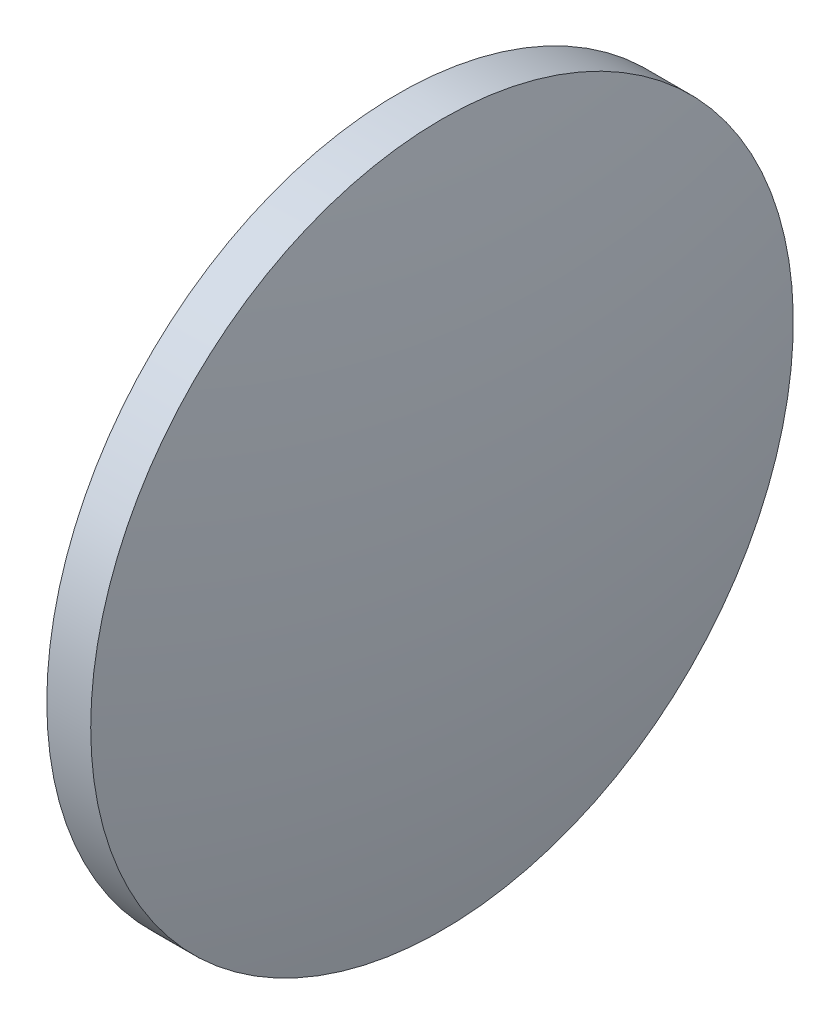
ISO-10303-21;
HEADER;
FILE_DESCRIPTION(('STEP AP214'),'2;1');
FILE_NAME('part.step','',(''),(''),'','','');
FILE_SCHEMA(('AUTOMOTIVE_DESIGN { 1 0 10303 214 1 1 1 1 }'));
ENDSEC;
DATA;
#1=APPLICATION_CONTEXT('core data for automotive mechanical design processes');
#2=APPLICATION_PROTOCOL_DEFINITION('international standard','automotive_design',2000,#1);
#3=PRODUCT_CONTEXT('',#1,'mechanical');
#4=PRODUCT('Part','Part','',(#3));
#5=PRODUCT_RELATED_PRODUCT_CATEGORY('part','',(#4));
#6=PRODUCT_DEFINITION_FORMATION('','',#4);
#7=PRODUCT_DEFINITION_CONTEXT('part definition',#1,'design');
#8=PRODUCT_DEFINITION('design','',#6,#7);
#9=PRODUCT_DEFINITION_SHAPE('','',#8);
#10=(LENGTH_UNIT() NAMED_UNIT(*) SI_UNIT(.MILLI.,.METRE.));
#11=(NAMED_UNIT(*) PLANE_ANGLE_UNIT() SI_UNIT($,.RADIAN.));
#12=(NAMED_UNIT(*) SI_UNIT($,.STERADIAN.) SOLID_ANGLE_UNIT());
#13=UNCERTAINTY_MEASURE_WITH_UNIT(LENGTH_MEASURE(1.E-05),#10,'distance_accuracy_value','');
#14=(GEOMETRIC_REPRESENTATION_CONTEXT(3) GLOBAL_UNCERTAINTY_ASSIGNED_CONTEXT((#13)) GLOBAL_UNIT_ASSIGNED_CONTEXT((#10,
#11,#12)) REPRESENTATION_CONTEXT('',''));
#15=CARTESIAN_POINT('',(0.,0.,0.));
#16=DIRECTION('',(0.,0.,1.));
#17=DIRECTION('',(1.,0.,0.));
#18=AXIS2_PLACEMENT_3D('',#15,#16,#17);
#19=CARTESIAN_POINT('',(669.782880253086,193.849391549058,0.));
#20=DIRECTION('',(-1.,0.,0.));
#21=DIRECTION('',(0.,1.,0.));
#22=AXIS2_PLACEMENT_3D('',#19,#20,#21);
#23=SPHERICAL_SURFACE('',#22,103.539102564102);
#24=CARTESIAN_POINT('',(771.371982817189,193.849391549058,0.));
#25=DIRECTION('',(-1.,0.,0.));
#26=DIRECTION('',(0.,0.,1.));
#27=AXIS2_PLACEMENT_3D('',#24,#25,#26);
#28=CIRCLE('',#27,20.);
#29=CARTESIAN_POINT('',(771.371982817189,193.849391549058,20.));
#30=VERTEX_POINT('',#29);
#31=EDGE_CURVE('E10',#30,#30,#28,.T.);
#32=ORIENTED_EDGE('',*,*,#31,.F.);
#33=EDGE_LOOP('',(#32));
#34=FACE_BOUND('',#33,.T.);
#35=ADVANCED_FACE('F35',(#34),#23,.T.);
#36=CARTESIAN_POINT('',(764.177439636612,193.849391549058,0.));
#37=DIRECTION('',(-1.,0.,0.));
#38=DIRECTION('',(0.,0.,1.));
#39=AXIS2_PLACEMENT_3D('',#36,#37,#38);
#40=CYLINDRICAL_SURFACE('',#39,20.);
#41=CARTESIAN_POINT('',(768.871982817189,193.849391549058,0.));
#42=DIRECTION('',(-1.,0.,0.));
#43=DIRECTION('',(0.,0.,1.));
#44=AXIS2_PLACEMENT_3D('',#41,#42,#43);
#45=CIRCLE('',#44,20.);
#46=CARTESIAN_POINT('',(768.871982817189,193.849391549058,20.));
#47=VERTEX_POINT('',#46);
#48=EDGE_CURVE('E41',#47,#47,#45,.T.);
#49=ORIENTED_EDGE('',*,*,#48,.F.);
#50=EDGE_LOOP('',(#49));
#51=FACE_BOUND('',#50,.T.);
#52=ORIENTED_EDGE('',*,*,#31,.T.);
#53=EDGE_LOOP('',(#52));
#54=FACE_BOUND('',#53,.T.);
#55=ADVANCED_FACE('F49',(#51,#54),#40,.T.);
#56=CARTESIAN_POINT('',(768.871982817189,193.849391549058,0.));
#57=DIRECTION('',(1.,0.,0.));
#58=DIRECTION('',(0.,0.,-1.));
#59=AXIS2_PLACEMENT_3D('',#56,#57,#58);
#60=PLANE('',#59);
#61=ORIENTED_EDGE('',*,*,#48,.T.);
#62=EDGE_LOOP('',(#61));
#63=FACE_BOUND('',#62,.T.);
#64=ADVANCED_FACE('F47',(#63),#60,.F.);
#65=CLOSED_SHELL('',(#35,#55,#64));
#66=MANIFOLD_SOLID_BREP('B2',#65);
#67=ADVANCED_BREP_SHAPE_REPRESENTATION('',(#18,#66),#14);
#68=SHAPE_DEFINITION_REPRESENTATION(#9,#67);
ENDSEC;
END-ISO-10303-21;
